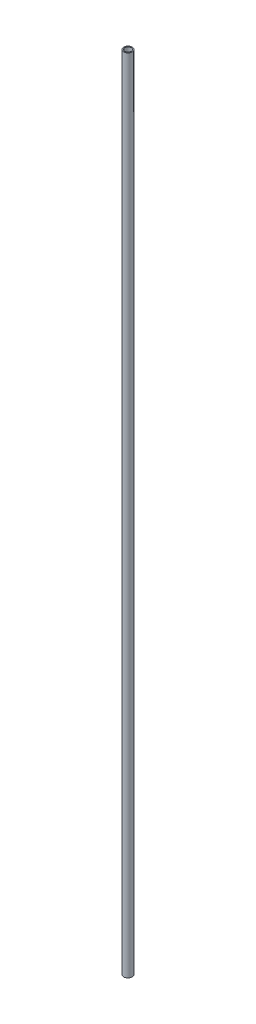
ISO-10303-21;
HEADER;
FILE_DESCRIPTION(('STEP AP214'),'2;1');
FILE_NAME('part.step','',(''),(''),'','','');
FILE_SCHEMA(('AUTOMOTIVE_DESIGN { 1 0 10303 214 1 1 1 1 }'));
ENDSEC;
DATA;
#1=APPLICATION_CONTEXT('core data for automotive mechanical design processes');
#2=APPLICATION_PROTOCOL_DEFINITION('international standard','automotive_design',2000,#1);
#3=PRODUCT_CONTEXT('',#1,'mechanical');
#4=PRODUCT('Part','Part','',(#3));
#5=PRODUCT_RELATED_PRODUCT_CATEGORY('part','',(#4));
#6=PRODUCT_DEFINITION_FORMATION('','',#4);
#7=PRODUCT_DEFINITION_CONTEXT('part definition',#1,'design');
#8=PRODUCT_DEFINITION('design','',#6,#7);
#9=PRODUCT_DEFINITION_SHAPE('','',#8);
#10=(LENGTH_UNIT() NAMED_UNIT(*) SI_UNIT(.MILLI.,.METRE.));
#11=(NAMED_UNIT(*) PLANE_ANGLE_UNIT() SI_UNIT($,.RADIAN.));
#12=(NAMED_UNIT(*) SI_UNIT($,.STERADIAN.) SOLID_ANGLE_UNIT());
#13=UNCERTAINTY_MEASURE_WITH_UNIT(LENGTH_MEASURE(1.E-05),#10,'distance_accuracy_value','');
#14=(GEOMETRIC_REPRESENTATION_CONTEXT(3) GLOBAL_UNCERTAINTY_ASSIGNED_CONTEXT((#13)) GLOBAL_UNIT_ASSIGNED_CONTEXT((#10,
#11,#12)) REPRESENTATION_CONTEXT('',''));
#15=CARTESIAN_POINT('',(0.,0.,0.));
#16=DIRECTION('',(0.,0.,1.));
#17=DIRECTION('',(1.,0.,0.));
#18=AXIS2_PLACEMENT_3D('',#15,#16,#17);
#19=CARTESIAN_POINT('',(0.,2000.,0.));
#20=DIRECTION('',(0.,1.,0.));
#21=DIRECTION('',(0.,0.,1.));
#22=AXIS2_PLACEMENT_3D('',#19,#20,#21);
#23=PLANE('',#22);
#24=CARTESIAN_POINT('',(0.,2000.,0.));
#25=DIRECTION('',(0.,1.,0.));
#26=DIRECTION('',(0.,0.,1.));
#27=AXIS2_PLACEMENT_3D('',#24,#25,#26);
#28=CIRCLE('',#27,10.668);
#29=CARTESIAN_POINT('',(0.,2000.,10.668));
#30=VERTEX_POINT('',#29);
#31=EDGE_CURVE('E10',#30,#30,#28,.T.);
#32=ORIENTED_EDGE('',*,*,#31,.T.);
#33=EDGE_LOOP('',(#32));
#34=FACE_BOUND('',#33,.T.);
#35=CARTESIAN_POINT('',(0.,2000.,0.));
#36=DIRECTION('',(0.,1.,0.));
#37=DIRECTION('',(0.,0.,1.));
#38=AXIS2_PLACEMENT_3D('',#35,#36,#37);
#39=CIRCLE('',#38,7.8994);
#40=CARTESIAN_POINT('',(0.,2000.,7.8994));
#41=VERTEX_POINT('',#40);
#42=EDGE_CURVE('E43',#41,#41,#39,.T.);
#43=ORIENTED_EDGE('',*,*,#42,.F.);
#44=EDGE_LOOP('',(#43));
#45=FACE_BOUND('',#44,.T.);
#46=ADVANCED_FACE('F32',(#34,#45),#23,.T.);
#47=CARTESIAN_POINT('',(0.,0.,0.));
#48=DIRECTION('',(0.,1.,0.));
#49=DIRECTION('',(0.,0.,1.));
#50=AXIS2_PLACEMENT_3D('',#47,#48,#49);
#51=PLANE('',#50);
#52=CARTESIAN_POINT('',(0.,0.,0.));
#53=DIRECTION('',(0.,1.,0.));
#54=DIRECTION('',(0.,0.,1.));
#55=AXIS2_PLACEMENT_3D('',#52,#53,#54);
#56=CIRCLE('',#55,10.668);
#57=CARTESIAN_POINT('',(0.,0.,10.668));
#58=VERTEX_POINT('',#57);
#59=EDGE_CURVE('E36',#58,#58,#56,.T.);
#60=ORIENTED_EDGE('',*,*,#59,.F.);
#61=EDGE_LOOP('',(#60));
#62=FACE_BOUND('',#61,.T.);
#63=CARTESIAN_POINT('',(0.,0.,0.));
#64=DIRECTION('',(0.,1.,0.));
#65=DIRECTION('',(0.,0.,1.));
#66=AXIS2_PLACEMENT_3D('',#63,#64,#65);
#67=CIRCLE('',#66,7.8994);
#68=CARTESIAN_POINT('',(0.,0.,7.8994));
#69=VERTEX_POINT('',#68);
#70=EDGE_CURVE('E45',#69,#69,#67,.T.);
#71=ORIENTED_EDGE('',*,*,#70,.T.);
#72=EDGE_LOOP('',(#71));
#73=FACE_BOUND('',#72,.T.);
#74=ADVANCED_FACE('F55',(#62,#73),#51,.F.);
#75=CARTESIAN_POINT('',(0.,2000.,0.));
#76=DIRECTION('',(0.,-1.,0.));
#77=DIRECTION('',(0.,0.,-1.));
#78=AXIS2_PLACEMENT_3D('',#75,#76,#77);
#79=CYLINDRICAL_SURFACE('',#78,10.668);
#80=ORIENTED_EDGE('',*,*,#31,.F.);
#81=EDGE_LOOP('',(#80));
#82=FACE_BOUND('',#81,.T.);
#83=ORIENTED_EDGE('',*,*,#59,.T.);
#84=EDGE_LOOP('',(#83));
#85=FACE_BOUND('',#84,.T.);
#86=ADVANCED_FACE('F34',(#82,#85),#79,.T.);
#87=CARTESIAN_POINT('',(0.,2000.,0.));
#88=DIRECTION('',(0.,-1.,0.));
#89=DIRECTION('',(0.,0.,-1.));
#90=AXIS2_PLACEMENT_3D('',#87,#88,#89);
#91=CYLINDRICAL_SURFACE('',#90,7.8994);
#92=ORIENTED_EDGE('',*,*,#42,.T.);
#93=EDGE_LOOP('',(#92));
#94=FACE_BOUND('',#93,.T.);
#95=ORIENTED_EDGE('',*,*,#70,.F.);
#96=EDGE_LOOP('',(#95));
#97=FACE_BOUND('',#96,.T.);
#98=ADVANCED_FACE('F51',(#94,#97),#91,.F.);
#99=CLOSED_SHELL('',(#46,#74,#86,#98));
#100=MANIFOLD_SOLID_BREP('B2',#99);
#101=ADVANCED_BREP_SHAPE_REPRESENTATION('',(#18,#100),#14);
#102=SHAPE_DEFINITION_REPRESENTATION(#9,#101);
ENDSEC;
END-ISO-10303-21;
